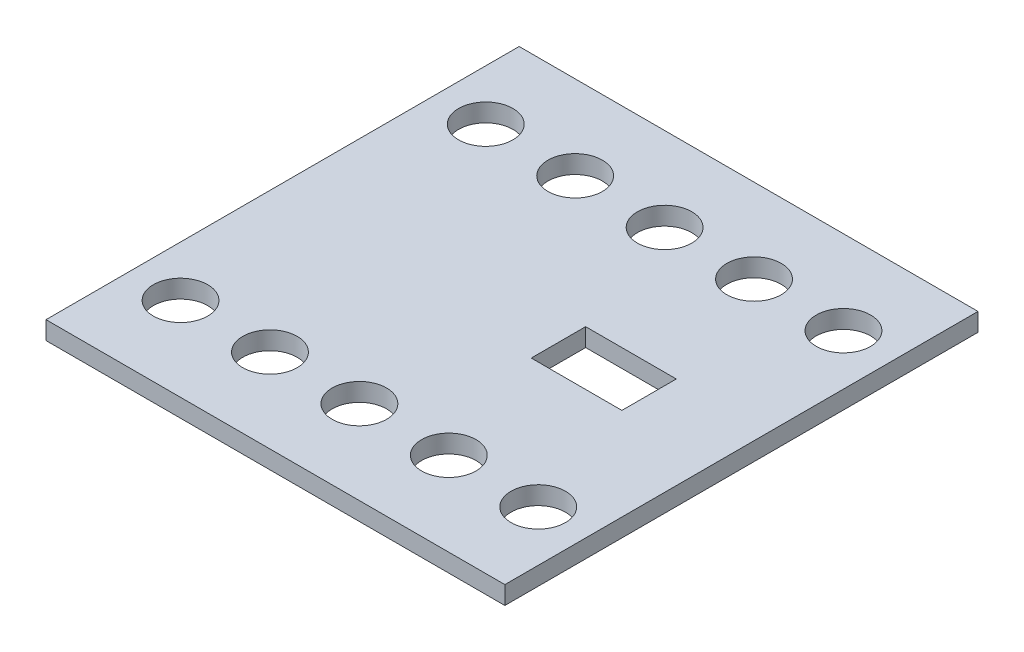
ISO-10303-21;
HEADER;
FILE_DESCRIPTION(('STEP AP214'),'2;1');
FILE_NAME('part.step','',(''),(''),'','','');
FILE_SCHEMA(('AUTOMOTIVE_DESIGN { 1 0 10303 214 1 1 1 1 }'));
ENDSEC;
DATA;
#1=APPLICATION_CONTEXT('core data for automotive mechanical design processes');
#2=APPLICATION_PROTOCOL_DEFINITION('international standard','automotive_design',2000,#1);
#3=PRODUCT_CONTEXT('',#1,'mechanical');
#4=PRODUCT('Part','Part','',(#3));
#5=PRODUCT_RELATED_PRODUCT_CATEGORY('part','',(#4));
#6=PRODUCT_DEFINITION_FORMATION('','',#4);
#7=PRODUCT_DEFINITION_CONTEXT('part definition',#1,'design');
#8=PRODUCT_DEFINITION('design','',#6,#7);
#9=PRODUCT_DEFINITION_SHAPE('','',#8);
#10=(LENGTH_UNIT() NAMED_UNIT(*) SI_UNIT(.MILLI.,.METRE.));
#11=(NAMED_UNIT(*) PLANE_ANGLE_UNIT() SI_UNIT($,.RADIAN.));
#12=(NAMED_UNIT(*) SI_UNIT($,.STERADIAN.) SOLID_ANGLE_UNIT());
#13=UNCERTAINTY_MEASURE_WITH_UNIT(LENGTH_MEASURE(1.E-05),#10,'distance_accuracy_value','');
#14=(GEOMETRIC_REPRESENTATION_CONTEXT(3) GLOBAL_UNCERTAINTY_ASSIGNED_CONTEXT((#13)) GLOBAL_UNIT_ASSIGNED_CONTEXT((#10,
#11,#12)) REPRESENTATION_CONTEXT('',''));
#15=CARTESIAN_POINT('',(0.,0.,0.));
#16=DIRECTION('',(0.,0.,1.));
#17=DIRECTION('',(1.,0.,0.));
#18=AXIS2_PLACEMENT_3D('',#15,#16,#17);
#19=CARTESIAN_POINT('',(-12.214606,-56.16702,0.));
#20=DIRECTION('',(0.,-1.,0.));
#21=DIRECTION('',(0.,0.,-1.));
#22=AXIS2_PLACEMENT_3D('',#19,#20,#21);
#23=PLANE('',#22);
#24=DIRECTION('',(0.,0.,-1.));
#25=VECTOR('',#24,1.);
#26=CARTESIAN_POINT('',(-20.250531,-56.16702,0.));
#27=LINE('',#26,#25);
#28=CARTESIAN_POINT('',(-20.250531,-56.16702,-3.61616625));
#29=VERTEX_POINT('',#28);
#30=CARTESIAN_POINT('',(-20.250531,-56.16702,3.61616625));
#31=VERTEX_POINT('',#30);
#32=EDGE_CURVE('E105',#29,#31,#27,.F.);
#33=ORIENTED_EDGE('',*,*,#32,.F.);
#34=DIRECTION('',(1.,0.,0.));
#35=VECTOR('',#34,1.);
#36=CARTESIAN_POINT('',(-12.214606,-56.16702,-3.61616625));
#37=LINE('',#36,#35);
#38=CARTESIAN_POINT('',(-4.178681,-56.16702,-3.61616625));
#39=VERTEX_POINT('',#38);
#40=EDGE_CURVE('E107',#39,#29,#37,.F.);
#41=ORIENTED_EDGE('',*,*,#40,.F.);
#42=DIRECTION('',(0.,0.,1.));
#43=VECTOR('',#42,1.);
#44=CARTESIAN_POINT('',(-4.178681,-56.16702,0.));
#45=LINE('',#44,#43);
#46=CARTESIAN_POINT('',(-4.178681,-56.16702,3.61616625));
#47=VERTEX_POINT('',#46);
#48=EDGE_CURVE('E208',#47,#39,#45,.F.);
#49=ORIENTED_EDGE('',*,*,#48,.F.);
#50=DIRECTION('',(1.,0.,0.));
#51=VECTOR('',#50,1.);
#52=CARTESIAN_POINT('',(-12.214606,-56.16702,3.61616625));
#53=LINE('',#52,#51);
#54=EDGE_CURVE('E103',#47,#31,#53,.F.);
#55=ORIENTED_EDGE('',*,*,#54,.T.);
#56=EDGE_LOOP('',(#33,#41,#49,#55));
#57=FACE_BOUND('',#56,.T.);
#58=ADVANCED_FACE('F17',(#57),#23,.T.);
#59=CARTESIAN_POINT('',(-12.214606,-56.43372,-3.61616625));
#60=DIRECTION('',(0.,0.,1.));
#61=DIRECTION('',(1.,0.,0.));
#62=AXIS2_PLACEMENT_3D('',#59,#60,#61);
#63=PLANE('',#62);
#64=DIRECTION('',(0.,1.,0.));
#65=VECTOR('',#64,1.);
#66=CARTESIAN_POINT('',(-20.250531,-56.43372,-3.61616625));
#67=LINE('',#66,#65);
#68=CARTESIAN_POINT('',(-20.250531,-56.70042,-3.61616625));
#69=VERTEX_POINT('',#68);
#70=EDGE_CURVE('E112',#69,#29,#67,.T.);
#71=ORIENTED_EDGE('',*,*,#70,.F.);
#72=DIRECTION('',(1.,0.,0.));
#73=VECTOR('',#72,1.);
#74=CARTESIAN_POINT('',(22.50059,-56.70042,-3.61616625));
#75=LINE('',#74,#73);
#76=CARTESIAN_POINT('',(-4.178681,-56.70042,-3.61616625));
#77=VERTEX_POINT('',#76);
#78=EDGE_CURVE('E205',#77,#69,#75,.F.);
#79=ORIENTED_EDGE('',*,*,#78,.F.);
#80=DIRECTION('',(0.,1.,0.));
#81=VECTOR('',#80,1.);
#82=CARTESIAN_POINT('',(-4.178681,-56.43372,-3.61616625));
#83=LINE('',#82,#81);
#84=EDGE_CURVE('E118',#39,#77,#83,.F.);
#85=ORIENTED_EDGE('',*,*,#84,.F.);
#86=ORIENTED_EDGE('',*,*,#40,.T.);
#87=EDGE_LOOP('',(#71,#79,#85,#86));
#88=FACE_BOUND('',#87,.T.);
#89=ADVANCED_FACE('F115',(#88),#63,.T.);
#90=CARTESIAN_POINT('',(-20.250531,-56.43372,0.));
#91=DIRECTION('',(1.,0.,0.));
#92=DIRECTION('',(0.,0.,-1.));
#93=AXIS2_PLACEMENT_3D('',#90,#91,#92);
#94=PLANE('',#93);
#95=DIRECTION('',(0.,0.,-1.));
#96=VECTOR('',#95,1.);
#97=CARTESIAN_POINT('',(-20.250531,-56.70042,-23.20036));
#98=LINE('',#97,#96);
#99=CARTESIAN_POINT('',(-20.250531,-56.70042,3.61616625));
#100=VERTEX_POINT('',#99);
#101=EDGE_CURVE('E123',#69,#100,#98,.F.);
#102=ORIENTED_EDGE('',*,*,#101,.F.);
#103=ORIENTED_EDGE('',*,*,#70,.T.);
#104=ORIENTED_EDGE('',*,*,#32,.T.);
#105=DIRECTION('',(0.,1.,0.));
#106=VECTOR('',#105,1.);
#107=CARTESIAN_POINT('',(-20.250531,-56.43372,3.61616625));
#108=LINE('',#107,#106);
#109=EDGE_CURVE('E126',#31,#100,#108,.F.);
#110=ORIENTED_EDGE('',*,*,#109,.T.);
#111=EDGE_LOOP('',(#102,#103,#104,#110));
#112=FACE_BOUND('',#111,.T.);
#113=ADVANCED_FACE('F121',(#112),#94,.T.);
#114=CARTESIAN_POINT('',(-12.214606,-56.43372,3.61616625));
#115=DIRECTION('',(0.,0.,1.));
#116=DIRECTION('',(1.,0.,0.));
#117=AXIS2_PLACEMENT_3D('',#114,#115,#116);
#118=PLANE('',#117);
#119=DIRECTION('',(1.,0.,0.));
#120=VECTOR('',#119,1.);
#121=CARTESIAN_POINT('',(22.50059,-56.70042,3.61616625));
#122=LINE('',#121,#120);
#123=CARTESIAN_POINT('',(-4.178681,-56.70042,3.61616625));
#124=VERTEX_POINT('',#123);
#125=EDGE_CURVE('E195',#100,#124,#122,.T.);
#126=ORIENTED_EDGE('',*,*,#125,.F.);
#127=ORIENTED_EDGE('',*,*,#109,.F.);
#128=ORIENTED_EDGE('',*,*,#54,.F.);
#129=DIRECTION('',(0.,1.,0.));
#130=VECTOR('',#129,1.);
#131=CARTESIAN_POINT('',(-4.178681,-56.43372,3.61616625));
#132=LINE('',#131,#130);
#133=EDGE_CURVE('E210',#124,#47,#132,.T.);
#134=ORIENTED_EDGE('',*,*,#133,.F.);
#135=EDGE_LOOP('',(#126,#127,#128,#134));
#136=FACE_BOUND('',#135,.T.);
#137=ADVANCED_FACE('F214',(#136),#118,.F.);
#138=CARTESIAN_POINT('',(-4.178681,-56.43372,0.));
#139=DIRECTION('',(-1.,0.,0.));
#140=DIRECTION('',(0.,0.,1.));
#141=AXIS2_PLACEMENT_3D('',#138,#139,#140);
#142=PLANE('',#141);
#143=ORIENTED_EDGE('',*,*,#48,.T.);
#144=ORIENTED_EDGE('',*,*,#84,.T.);
#145=DIRECTION('',(0.,0.,-1.));
#146=VECTOR('',#145,1.);
#147=CARTESIAN_POINT('',(-4.178681,-56.70042,-23.20036));
#148=LINE('',#147,#146);
#149=EDGE_CURVE('E191',#124,#77,#148,.T.);
#150=ORIENTED_EDGE('',*,*,#149,.F.);
#151=ORIENTED_EDGE('',*,*,#133,.T.);
#152=EDGE_LOOP('',(#143,#144,#150,#151));
#153=FACE_BOUND('',#152,.T.);
#154=ADVANCED_FACE('F218',(#153),#142,.T.);
#155=CARTESIAN_POINT('',(22.50059,-56.70042,-23.20036));
#156=DIRECTION('',(0.,-1.,0.));
#157=DIRECTION('',(0.,0.,-1.));
#158=AXIS2_PLACEMENT_3D('',#155,#156,#157);
#159=PLANE('',#158);
#160=DIRECTION('',(1.,0.,0.));
#161=VECTOR('',#160,1.);
#162=CARTESIAN_POINT('',(0.,-56.70042,-23.20036));
#163=LINE('',#162,#161);
#164=CARTESIAN_POINT('',(-22.50059,-56.70042,-23.20036));
#165=VERTEX_POINT('',#164);
#166=CARTESIAN_POINT('',(22.50059,-56.70042,-23.20036));
#167=VERTEX_POINT('',#166);
#168=EDGE_CURVE('E558',#165,#167,#163,.T.);
#169=ORIENTED_EDGE('',*,*,#168,.T.);
#170=DIRECTION('',(0.,0.,-1.));
#171=VECTOR('',#170,1.);
#172=CARTESIAN_POINT('',(22.50059,-56.70042,-23.20036));
#173=LINE('',#172,#171);
#174=CARTESIAN_POINT('',(22.50059,-56.70042,23.20036));
#175=VERTEX_POINT('',#174);
#176=EDGE_CURVE('E560',#175,#167,#173,.T.);
#177=ORIENTED_EDGE('',*,*,#176,.F.);
#178=DIRECTION('',(1.,0.,0.));
#179=VECTOR('',#178,1.);
#180=CARTESIAN_POINT('',(0.,-56.70042,23.20036));
#181=LINE('',#180,#179);
#182=CARTESIAN_POINT('',(-22.50059,-56.70042,23.20036));
#183=VERTEX_POINT('',#182);
#184=EDGE_CURVE('E519',#183,#175,#181,.T.);
#185=ORIENTED_EDGE('',*,*,#184,.F.);
#186=DIRECTION('',(0.,0.,1.));
#187=VECTOR('',#186,1.);
#188=CARTESIAN_POINT('',(-22.50059,-56.70042,-23.20036));
#189=LINE('',#188,#187);
#190=EDGE_CURVE('E161',#165,#183,#189,.T.);
#191=ORIENTED_EDGE('',*,*,#190,.F.);
#192=EDGE_LOOP('',(#169,#177,#185,#191));
#193=FACE_BOUND('',#192,.T.);
#194=DIRECTION('',(1.,0.,0.));
#195=VECTOR('',#194,1.);
#196=CARTESIAN_POINT('',(9.000236,-56.70042,2.667));
#197=LINE('',#196,#195);
#198=CARTESIAN_POINT('',(4.555236,-56.70042,2.667));
#199=VERTEX_POINT('',#198);
#200=CARTESIAN_POINT('',(13.445236,-56.70042,2.667));
#201=VERTEX_POINT('',#200);
#202=EDGE_CURVE('E532',#199,#201,#197,.T.);
#203=ORIENTED_EDGE('',*,*,#202,.T.);
#204=DIRECTION('',(0.,0.,1.));
#205=VECTOR('',#204,1.);
#206=CARTESIAN_POINT('',(13.445236,-56.70042,0.));
#207=LINE('',#206,#205);
#208=CARTESIAN_POINT('',(13.445236,-56.70042,-2.667));
#209=VERTEX_POINT('',#208);
#210=EDGE_CURVE('E535',#209,#201,#207,.T.);
#211=ORIENTED_EDGE('',*,*,#210,.F.);
#212=DIRECTION('',(1.,0.,0.));
#213=VECTOR('',#212,1.);
#214=CARTESIAN_POINT('',(9.000236,-56.70042,-2.667));
#215=LINE('',#214,#213);
#216=CARTESIAN_POINT('',(4.555236,-56.70042,-2.667));
#217=VERTEX_POINT('',#216);
#218=EDGE_CURVE('E165',#217,#209,#215,.T.);
#219=ORIENTED_EDGE('',*,*,#218,.F.);
#220=DIRECTION('',(0.,0.,-1.));
#221=VECTOR('',#220,1.);
#222=CARTESIAN_POINT('',(4.555236,-56.70042,0.));
#223=LINE('',#222,#221);
#224=EDGE_CURVE('E520',#199,#217,#223,.T.);
#225=ORIENTED_EDGE('',*,*,#224,.F.);
#226=EDGE_LOOP('',(#203,#211,#219,#225));
#227=FACE_BOUND('',#226,.T.);
#228=ORIENTED_EDGE('',*,*,#125,.T.);
#229=ORIENTED_EDGE('',*,*,#149,.T.);
#230=ORIENTED_EDGE('',*,*,#78,.T.);
#231=ORIENTED_EDGE('',*,*,#101,.T.);
#232=EDGE_LOOP('',(#228,#229,#230,#231));
#233=FACE_BOUND('',#232,.T.);
#234=CARTESIAN_POINT('',(-17.5403933333333,-56.70042,-14.966315));
#235=DIRECTION('',(0.,-1.,0.));
#236=DIRECTION('',(0.,0.,-1.));
#237=AXIS2_PLACEMENT_3D('',#234,#235,#236);
#238=CIRCLE('',#237,2.667);
#239=CARTESIAN_POINT('',(-17.5403933333333,-56.70042,-17.633315));
#240=VERTEX_POINT('',#239);
#241=EDGE_CURVE('E162',#240,#240,#238,.F.);
#242=ORIENTED_EDGE('',*,*,#241,.T.);
#243=EDGE_LOOP('',(#242));
#244=FACE_BOUND('',#243,.T.);
#245=CARTESIAN_POINT('',(-8.77019666666667,-56.70042,-14.966315));
#246=DIRECTION('',(0.,-1.,0.));
#247=DIRECTION('',(0.,0.,-1.));
#248=AXIS2_PLACEMENT_3D('',#245,#246,#247);
#249=CIRCLE('',#248,2.667);
#250=CARTESIAN_POINT('',(-8.77019666666667,-56.70042,-17.633315));
#251=VERTEX_POINT('',#250);
#252=EDGE_CURVE('E166',#251,#251,#249,.F.);
#253=ORIENTED_EDGE('',*,*,#252,.T.);
#254=EDGE_LOOP('',(#253));
#255=FACE_BOUND('',#254,.T.);
#256=CARTESIAN_POINT('',(0.,-56.70042,-14.966315));
#257=DIRECTION('',(0.,-1.,0.));
#258=DIRECTION('',(0.,0.,-1.));
#259=AXIS2_PLACEMENT_3D('',#256,#257,#258);
#260=CIRCLE('',#259,2.667);
#261=CARTESIAN_POINT('',(0.,-56.70042,-17.633315));
#262=VERTEX_POINT('',#261);
#263=EDGE_CURVE('E169',#262,#262,#260,.F.);
#264=ORIENTED_EDGE('',*,*,#263,.T.);
#265=EDGE_LOOP('',(#264));
#266=FACE_BOUND('',#265,.T.);
#267=CARTESIAN_POINT('',(8.77019666666667,-56.70042,-14.966315));
#268=DIRECTION('',(0.,-1.,0.));
#269=DIRECTION('',(0.,0.,-1.));
#270=AXIS2_PLACEMENT_3D('',#267,#268,#269);
#271=CIRCLE('',#270,2.667);
#272=CARTESIAN_POINT('',(8.77019666666667,-56.70042,-17.633315));
#273=VERTEX_POINT('',#272);
#274=EDGE_CURVE('E172',#273,#273,#271,.F.);
#275=ORIENTED_EDGE('',*,*,#274,.T.);
#276=EDGE_LOOP('',(#275));
#277=FACE_BOUND('',#276,.T.);
#278=CARTESIAN_POINT('',(17.5403933333333,-56.70042,-14.966315));
#279=DIRECTION('',(0.,-1.,0.));
#280=DIRECTION('',(0.,0.,-1.));
#281=AXIS2_PLACEMENT_3D('',#278,#279,#280);
#282=CIRCLE('',#281,2.667);
#283=CARTESIAN_POINT('',(17.5403933333333,-56.70042,-17.633315));
#284=VERTEX_POINT('',#283);
#285=EDGE_CURVE('E175',#284,#284,#282,.F.);
#286=ORIENTED_EDGE('',*,*,#285,.T.);
#287=EDGE_LOOP('',(#286));
#288=FACE_BOUND('',#287,.T.);
#289=CARTESIAN_POINT('',(-17.5403933333333,-56.70042,14.966315));
#290=DIRECTION('',(0.,-1.,0.));
#291=DIRECTION('',(0.,0.,-1.));
#292=AXIS2_PLACEMENT_3D('',#289,#290,#291);
#293=CIRCLE('',#292,2.667);
#294=CARTESIAN_POINT('',(-17.5403933333333,-56.70042,12.299315));
#295=VERTEX_POINT('',#294);
#296=EDGE_CURVE('E178',#295,#295,#293,.F.);
#297=ORIENTED_EDGE('',*,*,#296,.T.);
#298=EDGE_LOOP('',(#297));
#299=FACE_BOUND('',#298,.T.);
#300=CARTESIAN_POINT('',(-8.77019666666667,-56.70042,14.966315));
#301=DIRECTION('',(0.,-1.,0.));
#302=DIRECTION('',(0.,0.,-1.));
#303=AXIS2_PLACEMENT_3D('',#300,#301,#302);
#304=CIRCLE('',#303,2.667);
#305=CARTESIAN_POINT('',(-8.77019666666667,-56.70042,12.299315));
#306=VERTEX_POINT('',#305);
#307=EDGE_CURVE('E181',#306,#306,#304,.F.);
#308=ORIENTED_EDGE('',*,*,#307,.T.);
#309=EDGE_LOOP('',(#308));
#310=FACE_BOUND('',#309,.T.);
#311=CARTESIAN_POINT('',(0.,-56.70042,14.966315));
#312=DIRECTION('',(0.,-1.,0.));
#313=DIRECTION('',(0.,0.,-1.));
#314=AXIS2_PLACEMENT_3D('',#311,#312,#313);
#315=CIRCLE('',#314,2.667);
#316=CARTESIAN_POINT('',(0.,-56.70042,12.299315));
#317=VERTEX_POINT('',#316);
#318=EDGE_CURVE('E184',#317,#317,#315,.F.);
#319=ORIENTED_EDGE('',*,*,#318,.T.);
#320=EDGE_LOOP('',(#319));
#321=FACE_BOUND('',#320,.T.);
#322=CARTESIAN_POINT('',(8.77019666666667,-56.70042,14.966315));
#323=DIRECTION('',(0.,-1.,0.));
#324=DIRECTION('',(0.,0.,-1.));
#325=AXIS2_PLACEMENT_3D('',#322,#323,#324);
#326=CIRCLE('',#325,2.667);
#327=CARTESIAN_POINT('',(8.77019666666667,-56.70042,12.299315));
#328=VERTEX_POINT('',#327);
#329=EDGE_CURVE('E186',#328,#328,#326,.F.);
#330=ORIENTED_EDGE('',*,*,#329,.T.);
#331=EDGE_LOOP('',(#330));
#332=FACE_BOUND('',#331,.T.);
#333=CARTESIAN_POINT('',(17.5403933333333,-56.70042,14.966315));
#334=DIRECTION('',(0.,-1.,0.));
#335=DIRECTION('',(0.,0.,-1.));
#336=AXIS2_PLACEMENT_3D('',#333,#334,#335);
#337=CIRCLE('',#336,2.667);
#338=CARTESIAN_POINT('',(17.5403933333333,-56.70042,12.299315));
#339=VERTEX_POINT('',#338);
#340=EDGE_CURVE('E20',#339,#339,#337,.F.);
#341=ORIENTED_EDGE('',*,*,#340,.T.);
#342=EDGE_LOOP('',(#341));
#343=FACE_BOUND('',#342,.T.);
#344=ADVANCED_FACE('F215',(#193,#227,#233,#244,#255,#266,#277,#288,#299,#310,#321,#332,#343),
#159,.T.);
#345=CARTESIAN_POINT('',(17.5403933333333,-55.81142,14.966315));
#346=DIRECTION('',(0.,-1.,0.));
#347=DIRECTION('',(0.,0.,-1.));
#348=AXIS2_PLACEMENT_3D('',#345,#346,#347);
#349=CYLINDRICAL_SURFACE('',#348,2.667);
#350=CARTESIAN_POINT('',(17.5403933333333,-54.92242,14.966315));
#351=DIRECTION('',(0.,-1.,0.));
#352=DIRECTION('',(0.,0.,-1.));
#353=AXIS2_PLACEMENT_3D('',#350,#351,#352);
#354=CIRCLE('',#353,2.667);
#355=CARTESIAN_POINT('',(17.5403933333333,-54.92242,12.299315));
#356=VERTEX_POINT('',#355);
#357=EDGE_CURVE('E158',#356,#356,#354,.T.);
#358=ORIENTED_EDGE('',*,*,#357,.F.);
#359=EDGE_LOOP('',(#358));
#360=FACE_BOUND('',#359,.T.);
#361=ORIENTED_EDGE('',*,*,#340,.F.);
#362=EDGE_LOOP('',(#361));
#363=FACE_BOUND('',#362,.T.);
#364=ADVANCED_FACE('F226',(#360,#363),#349,.F.);
#365=CARTESIAN_POINT('',(8.77019666666667,-55.81142,14.966315));
#366=DIRECTION('',(0.,-1.,0.));
#367=DIRECTION('',(0.,0.,-1.));
#368=AXIS2_PLACEMENT_3D('',#365,#366,#367);
#369=CYLINDRICAL_SURFACE('',#368,2.667);
#370=CARTESIAN_POINT('',(8.77019666666667,-54.92242,14.966315));
#371=DIRECTION('',(0.,-1.,0.));
#372=DIRECTION('',(0.,0.,-1.));
#373=AXIS2_PLACEMENT_3D('',#370,#371,#372);
#374=CIRCLE('',#373,2.667);
#375=CARTESIAN_POINT('',(8.77019666666667,-54.92242,12.299315));
#376=VERTEX_POINT('',#375);
#377=EDGE_CURVE('E155',#376,#376,#374,.T.);
#378=ORIENTED_EDGE('',*,*,#377,.F.);
#379=EDGE_LOOP('',(#378));
#380=FACE_BOUND('',#379,.T.);
#381=ORIENTED_EDGE('',*,*,#329,.F.);
#382=EDGE_LOOP('',(#381));
#383=FACE_BOUND('',#382,.T.);
#384=ADVANCED_FACE('F301',(#380,#383),#369,.F.);
#385=CARTESIAN_POINT('',(0.,-55.81142,14.966315));
#386=DIRECTION('',(0.,-1.,0.));
#387=DIRECTION('',(0.,0.,-1.));
#388=AXIS2_PLACEMENT_3D('',#385,#386,#387);
#389=CYLINDRICAL_SURFACE('',#388,2.667);
#390=CARTESIAN_POINT('',(0.,-54.92242,14.966315));
#391=DIRECTION('',(0.,-1.,0.));
#392=DIRECTION('',(0.,0.,-1.));
#393=AXIS2_PLACEMENT_3D('',#390,#391,#392);
#394=CIRCLE('',#393,2.667);
#395=CARTESIAN_POINT('',(0.,-54.92242,12.299315));
#396=VERTEX_POINT('',#395);
#397=EDGE_CURVE('E152',#396,#396,#394,.T.);
#398=ORIENTED_EDGE('',*,*,#397,.F.);
#399=EDGE_LOOP('',(#398));
#400=FACE_BOUND('',#399,.T.);
#401=ORIENTED_EDGE('',*,*,#318,.F.);
#402=EDGE_LOOP('',(#401));
#403=FACE_BOUND('',#402,.T.);
#404=ADVANCED_FACE('F297',(#400,#403),#389,.F.);
#405=CARTESIAN_POINT('',(-8.77019666666667,-55.81142,14.966315));
#406=DIRECTION('',(0.,-1.,0.));
#407=DIRECTION('',(0.,0.,-1.));
#408=AXIS2_PLACEMENT_3D('',#405,#406,#407);
#409=CYLINDRICAL_SURFACE('',#408,2.667);
#410=CARTESIAN_POINT('',(-8.77019666666667,-54.92242,14.966315));
#411=DIRECTION('',(0.,-1.,0.));
#412=DIRECTION('',(0.,0.,-1.));
#413=AXIS2_PLACEMENT_3D('',#410,#411,#412);
#414=CIRCLE('',#413,2.667);
#415=CARTESIAN_POINT('',(-8.77019666666667,-54.92242,12.299315));
#416=VERTEX_POINT('',#415);
#417=EDGE_CURVE('E149',#416,#416,#414,.T.);
#418=ORIENTED_EDGE('',*,*,#417,.F.);
#419=EDGE_LOOP('',(#418));
#420=FACE_BOUND('',#419,.T.);
#421=ORIENTED_EDGE('',*,*,#307,.F.);
#422=EDGE_LOOP('',(#421));
#423=FACE_BOUND('',#422,.T.);
#424=ADVANCED_FACE('F293',(#420,#423),#409,.F.);
#425=CARTESIAN_POINT('',(-17.5403933333333,-55.81142,14.966315));
#426=DIRECTION('',(0.,-1.,0.));
#427=DIRECTION('',(0.,0.,-1.));
#428=AXIS2_PLACEMENT_3D('',#425,#426,#427);
#429=CYLINDRICAL_SURFACE('',#428,2.667);
#430=CARTESIAN_POINT('',(-17.5403933333333,-54.92242,14.966315));
#431=DIRECTION('',(0.,-1.,0.));
#432=DIRECTION('',(0.,0.,-1.));
#433=AXIS2_PLACEMENT_3D('',#430,#431,#432);
#434=CIRCLE('',#433,2.667);
#435=CARTESIAN_POINT('',(-17.5403933333333,-54.92242,12.299315));
#436=VERTEX_POINT('',#435);
#437=EDGE_CURVE('E146',#436,#436,#434,.T.);
#438=ORIENTED_EDGE('',*,*,#437,.F.);
#439=EDGE_LOOP('',(#438));
#440=FACE_BOUND('',#439,.T.);
#441=ORIENTED_EDGE('',*,*,#296,.F.);
#442=EDGE_LOOP('',(#441));
#443=FACE_BOUND('',#442,.T.);
#444=ADVANCED_FACE('F289',(#440,#443),#429,.F.);
#445=CARTESIAN_POINT('',(17.5403933333333,-55.81142,-14.966315));
#446=DIRECTION('',(0.,-1.,0.));
#447=DIRECTION('',(0.,0.,-1.));
#448=AXIS2_PLACEMENT_3D('',#445,#446,#447);
#449=CYLINDRICAL_SURFACE('',#448,2.667);
#450=CARTESIAN_POINT('',(17.5403933333333,-54.92242,-14.966315));
#451=DIRECTION('',(0.,-1.,0.));
#452=DIRECTION('',(0.,0.,-1.));
#453=AXIS2_PLACEMENT_3D('',#450,#451,#452);
#454=CIRCLE('',#453,2.667);
#455=CARTESIAN_POINT('',(17.5403933333333,-54.92242,-17.633315));
#456=VERTEX_POINT('',#455);
#457=EDGE_CURVE('E143',#456,#456,#454,.T.);
#458=ORIENTED_EDGE('',*,*,#457,.F.);
#459=EDGE_LOOP('',(#458));
#460=FACE_BOUND('',#459,.T.);
#461=ORIENTED_EDGE('',*,*,#285,.F.);
#462=EDGE_LOOP('',(#461));
#463=FACE_BOUND('',#462,.T.);
#464=ADVANCED_FACE('F285',(#460,#463),#449,.F.);
#465=CARTESIAN_POINT('',(8.77019666666667,-55.81142,-14.966315));
#466=DIRECTION('',(0.,-1.,0.));
#467=DIRECTION('',(0.,0.,-1.));
#468=AXIS2_PLACEMENT_3D('',#465,#466,#467);
#469=CYLINDRICAL_SURFACE('',#468,2.667);
#470=CARTESIAN_POINT('',(8.77019666666667,-54.92242,-14.966315));
#471=DIRECTION('',(0.,-1.,0.));
#472=DIRECTION('',(0.,0.,-1.));
#473=AXIS2_PLACEMENT_3D('',#470,#471,#472);
#474=CIRCLE('',#473,2.667);
#475=CARTESIAN_POINT('',(8.77019666666667,-54.92242,-17.633315));
#476=VERTEX_POINT('',#475);
#477=EDGE_CURVE('E140',#476,#476,#474,.T.);
#478=ORIENTED_EDGE('',*,*,#477,.F.);
#479=EDGE_LOOP('',(#478));
#480=FACE_BOUND('',#479,.T.);
#481=ORIENTED_EDGE('',*,*,#274,.F.);
#482=EDGE_LOOP('',(#481));
#483=FACE_BOUND('',#482,.T.);
#484=ADVANCED_FACE('F281',(#480,#483),#469,.F.);
#485=CARTESIAN_POINT('',(0.,-55.81142,-14.966315));
#486=DIRECTION('',(0.,-1.,0.));
#487=DIRECTION('',(0.,0.,-1.));
#488=AXIS2_PLACEMENT_3D('',#485,#486,#487);
#489=CYLINDRICAL_SURFACE('',#488,2.667);
#490=CARTESIAN_POINT('',(0.,-54.92242,-14.966315));
#491=DIRECTION('',(0.,-1.,0.));
#492=DIRECTION('',(0.,0.,-1.));
#493=AXIS2_PLACEMENT_3D('',#490,#491,#492);
#494=CIRCLE('',#493,2.667);
#495=CARTESIAN_POINT('',(0.,-54.92242,-17.633315));
#496=VERTEX_POINT('',#495);
#497=EDGE_CURVE('E137',#496,#496,#494,.T.);
#498=ORIENTED_EDGE('',*,*,#497,.F.);
#499=EDGE_LOOP('',(#498));
#500=FACE_BOUND('',#499,.T.);
#501=ORIENTED_EDGE('',*,*,#263,.F.);
#502=EDGE_LOOP('',(#501));
#503=FACE_BOUND('',#502,.T.);
#504=ADVANCED_FACE('F277',(#500,#503),#489,.F.);
#505=CARTESIAN_POINT('',(-8.77019666666667,-55.81142,-14.966315));
#506=DIRECTION('',(0.,-1.,0.));
#507=DIRECTION('',(0.,0.,-1.));
#508=AXIS2_PLACEMENT_3D('',#505,#506,#507);
#509=CYLINDRICAL_SURFACE('',#508,2.667);
#510=CARTESIAN_POINT('',(-8.77019666666667,-54.92242,-14.966315));
#511=DIRECTION('',(0.,-1.,0.));
#512=DIRECTION('',(0.,0.,-1.));
#513=AXIS2_PLACEMENT_3D('',#510,#511,#512);
#514=CIRCLE('',#513,2.667);
#515=CARTESIAN_POINT('',(-8.77019666666667,-54.92242,-17.633315));
#516=VERTEX_POINT('',#515);
#517=EDGE_CURVE('E134',#516,#516,#514,.T.);
#518=ORIENTED_EDGE('',*,*,#517,.F.);
#519=EDGE_LOOP('',(#518));
#520=FACE_BOUND('',#519,.T.);
#521=ORIENTED_EDGE('',*,*,#252,.F.);
#522=EDGE_LOOP('',(#521));
#523=FACE_BOUND('',#522,.T.);
#524=ADVANCED_FACE('F273',(#520,#523),#509,.F.);
#525=CARTESIAN_POINT('',(-17.5403933333333,-55.81142,-14.966315));
#526=DIRECTION('',(0.,-1.,0.));
#527=DIRECTION('',(0.,0.,-1.));
#528=AXIS2_PLACEMENT_3D('',#525,#526,#527);
#529=CYLINDRICAL_SURFACE('',#528,2.667);
#530=CARTESIAN_POINT('',(-17.5403933333333,-54.92242,-14.966315));
#531=DIRECTION('',(0.,-1.,0.));
#532=DIRECTION('',(0.,0.,-1.));
#533=AXIS2_PLACEMENT_3D('',#530,#531,#532);
#534=CIRCLE('',#533,2.667);
#535=CARTESIAN_POINT('',(-17.5403933333333,-54.92242,-17.633315));
#536=VERTEX_POINT('',#535);
#537=EDGE_CURVE('E130',#536,#536,#534,.T.);
#538=ORIENTED_EDGE('',*,*,#537,.F.);
#539=EDGE_LOOP('',(#538));
#540=FACE_BOUND('',#539,.T.);
#541=ORIENTED_EDGE('',*,*,#241,.F.);
#542=EDGE_LOOP('',(#541));
#543=FACE_BOUND('',#542,.T.);
#544=ADVANCED_FACE('F269',(#540,#543),#529,.F.);
#545=CARTESIAN_POINT('',(9.000236,-55.81142,-2.667));
#546=DIRECTION('',(0.,0.,1.));
#547=DIRECTION('',(1.,0.,0.));
#548=AXIS2_PLACEMENT_3D('',#545,#546,#547);
#549=PLANE('',#548);
#550=DIRECTION('',(0.,1.,0.));
#551=VECTOR('',#550,1.);
#552=CARTESIAN_POINT('',(4.555236,-55.81142,-2.667));
#553=LINE('',#552,#551);
#554=CARTESIAN_POINT('',(4.555236,-54.92242,-2.667));
#555=VERTEX_POINT('',#554);
#556=EDGE_CURVE('E513',#217,#555,#553,.T.);
#557=ORIENTED_EDGE('',*,*,#556,.F.);
#558=ORIENTED_EDGE('',*,*,#218,.T.);
#559=DIRECTION('',(0.,1.,0.));
#560=VECTOR('',#559,1.);
#561=CARTESIAN_POINT('',(13.445236,-55.81142,-2.667));
#562=LINE('',#561,#560);
#563=CARTESIAN_POINT('',(13.445236,-54.92242,-2.667));
#564=VERTEX_POINT('',#563);
#565=EDGE_CURVE('E534',#564,#209,#562,.F.);
#566=ORIENTED_EDGE('',*,*,#565,.F.);
#567=DIRECTION('',(-1.,0.,0.));
#568=VECTOR('',#567,1.);
#569=CARTESIAN_POINT('',(-22.50059,-54.92242,-2.667));
#570=LINE('',#569,#568);
#571=EDGE_CURVE('E133',#555,#564,#570,.F.);
#572=ORIENTED_EDGE('',*,*,#571,.F.);
#573=EDGE_LOOP('',(#557,#558,#566,#572));
#574=FACE_BOUND('',#573,.T.);
#575=ADVANCED_FACE('F265',(#574),#549,.T.);
#576=CARTESIAN_POINT('',(13.445236,-55.81142,0.));
#577=DIRECTION('',(-1.,0.,0.));
#578=DIRECTION('',(0.,0.,1.));
#579=AXIS2_PLACEMENT_3D('',#576,#577,#578);
#580=PLANE('',#579);
#581=DIRECTION('',(0.,0.,1.));
#582=VECTOR('',#581,1.);
#583=CARTESIAN_POINT('',(13.445236,-54.92242,-23.20036));
#584=LINE('',#583,#582);
#585=CARTESIAN_POINT('',(13.445236,-54.92242,2.667));
#586=VERTEX_POINT('',#585);
#587=EDGE_CURVE('E544',#564,#586,#584,.T.);
#588=ORIENTED_EDGE('',*,*,#587,.F.);
#589=ORIENTED_EDGE('',*,*,#565,.T.);
#590=ORIENTED_EDGE('',*,*,#210,.T.);
#591=DIRECTION('',(0.,1.,0.));
#592=VECTOR('',#591,1.);
#593=CARTESIAN_POINT('',(13.445236,-55.81142,2.667));
#594=LINE('',#593,#592);
#595=EDGE_CURVE('E527',#201,#586,#594,.T.);
#596=ORIENTED_EDGE('',*,*,#595,.T.);
#597=EDGE_LOOP('',(#588,#589,#590,#596));
#598=FACE_BOUND('',#597,.T.);
#599=ADVANCED_FACE('F261',(#598),#580,.T.);
#600=CARTESIAN_POINT('',(9.000236,-55.81142,2.667));
#601=DIRECTION('',(0.,0.,1.));
#602=DIRECTION('',(1.,0.,0.));
#603=AXIS2_PLACEMENT_3D('',#600,#601,#602);
#604=PLANE('',#603);
#605=ORIENTED_EDGE('',*,*,#202,.F.);
#606=DIRECTION('',(0.,1.,0.));
#607=VECTOR('',#606,1.);
#608=CARTESIAN_POINT('',(4.555236,-55.81142,2.667));
#609=LINE('',#608,#607);
#610=CARTESIAN_POINT('',(4.555236,-54.92242,2.667));
#611=VERTEX_POINT('',#610);
#612=EDGE_CURVE('E524',#611,#199,#609,.F.);
#613=ORIENTED_EDGE('',*,*,#612,.F.);
#614=DIRECTION('',(-1.,0.,0.));
#615=VECTOR('',#614,1.);
#616=CARTESIAN_POINT('',(-22.50059,-54.92242,2.667));
#617=LINE('',#616,#615);
#618=EDGE_CURVE('E541',#586,#611,#617,.T.);
#619=ORIENTED_EDGE('',*,*,#618,.F.);
#620=ORIENTED_EDGE('',*,*,#595,.F.);
#621=EDGE_LOOP('',(#605,#613,#619,#620));
#622=FACE_BOUND('',#621,.T.);
#623=ADVANCED_FACE('F257',(#622),#604,.F.);
#624=CARTESIAN_POINT('',(4.555236,-55.81142,0.));
#625=DIRECTION('',(1.,0.,0.));
#626=DIRECTION('',(0.,0.,-1.));
#627=AXIS2_PLACEMENT_3D('',#624,#625,#626);
#628=PLANE('',#627);
#629=ORIENTED_EDGE('',*,*,#224,.T.);
#630=ORIENTED_EDGE('',*,*,#556,.T.);
#631=DIRECTION('',(0.,0.,1.));
#632=VECTOR('',#631,1.);
#633=CARTESIAN_POINT('',(4.555236,-54.92242,-23.20036));
#634=LINE('',#633,#632);
#635=EDGE_CURVE('E543',#611,#555,#634,.F.);
#636=ORIENTED_EDGE('',*,*,#635,.F.);
#637=ORIENTED_EDGE('',*,*,#612,.T.);
#638=EDGE_LOOP('',(#629,#630,#636,#637));
#639=FACE_BOUND('',#638,.T.);
#640=ADVANCED_FACE('F253',(#639),#628,.T.);
#641=CARTESIAN_POINT('',(0.,-55.81142,23.20036));
#642=DIRECTION('',(0.,0.,1.));
#643=DIRECTION('',(1.,0.,0.));
#644=AXIS2_PLACEMENT_3D('',#641,#642,#643);
#645=PLANE('',#644);
#646=DIRECTION('',(0.,1.,0.));
#647=VECTOR('',#646,1.);
#648=CARTESIAN_POINT('',(-22.50059,-56.70042,23.20036));
#649=LINE('',#648,#647);
#650=CARTESIAN_POINT('',(-22.50059,-54.92242,23.20036));
#651=VERTEX_POINT('',#650);
#652=EDGE_CURVE('E553',#183,#651,#649,.T.);
#653=ORIENTED_EDGE('',*,*,#652,.F.);
#654=ORIENTED_EDGE('',*,*,#184,.T.);
#655=DIRECTION('',(0.,1.,0.));
#656=VECTOR('',#655,1.);
#657=CARTESIAN_POINT('',(22.50059,-55.81142,23.20036));
#658=LINE('',#657,#656);
#659=CARTESIAN_POINT('',(22.50059,-54.92242,23.20036));
#660=VERTEX_POINT('',#659);
#661=EDGE_CURVE('E563',#660,#175,#658,.F.);
#662=ORIENTED_EDGE('',*,*,#661,.F.);
#663=DIRECTION('',(-1.,0.,0.));
#664=VECTOR('',#663,1.);
#665=CARTESIAN_POINT('',(-22.50059,-54.92242,23.20036));
#666=LINE('',#665,#664);
#667=EDGE_CURVE('E573',#651,#660,#666,.F.);
#668=ORIENTED_EDGE('',*,*,#667,.F.);
#669=EDGE_LOOP('',(#653,#654,#662,#668));
#670=FACE_BOUND('',#669,.T.);
#671=ADVANCED_FACE('F249',(#670),#645,.T.);
#672=CARTESIAN_POINT('',(22.50059,-55.81142,-23.20036));
#673=DIRECTION('',(1.,0.,0.));
#674=DIRECTION('',(0.,0.,-1.));
#675=AXIS2_PLACEMENT_3D('',#672,#673,#674);
#676=PLANE('',#675);
#677=DIRECTION('',(0.,1.,0.));
#678=VECTOR('',#677,1.);
#679=CARTESIAN_POINT('',(22.50059,-55.81142,-23.20036));
#680=LINE('',#679,#678);
#681=CARTESIAN_POINT('',(22.50059,-54.92242,-23.20036));
#682=VERTEX_POINT('',#681);
#683=EDGE_CURVE('E556',#167,#682,#680,.T.);
#684=ORIENTED_EDGE('',*,*,#683,.T.);
#685=DIRECTION('',(0.,0.,1.));
#686=VECTOR('',#685,1.);
#687=CARTESIAN_POINT('',(22.50059,-54.92242,-23.20036));
#688=LINE('',#687,#686);
#689=EDGE_CURVE('E571',#660,#682,#688,.F.);
#690=ORIENTED_EDGE('',*,*,#689,.F.);
#691=ORIENTED_EDGE('',*,*,#661,.T.);
#692=ORIENTED_EDGE('',*,*,#176,.T.);
#693=EDGE_LOOP('',(#684,#690,#691,#692));
#694=FACE_BOUND('',#693,.T.);
#695=ADVANCED_FACE('F246',(#694),#676,.T.);
#696=CARTESIAN_POINT('',(0.,-55.81142,-23.20036));
#697=DIRECTION('',(0.,0.,1.));
#698=DIRECTION('',(1.,0.,0.));
#699=AXIS2_PLACEMENT_3D('',#696,#697,#698);
#700=PLANE('',#699);
#701=ORIENTED_EDGE('',*,*,#168,.F.);
#702=DIRECTION('',(0.,1.,0.));
#703=VECTOR('',#702,1.);
#704=CARTESIAN_POINT('',(-22.50059,-56.70042,-23.20036));
#705=LINE('',#704,#703);
#706=CARTESIAN_POINT('',(-22.50059,-54.92242,-23.20036));
#707=VERTEX_POINT('',#706);
#708=EDGE_CURVE('E35',#707,#165,#705,.F.);
#709=ORIENTED_EDGE('',*,*,#708,.F.);
#710=DIRECTION('',(-1.,0.,0.));
#711=VECTOR('',#710,1.);
#712=CARTESIAN_POINT('',(-22.50059,-54.92242,-23.20036));
#713=LINE('',#712,#711);
#714=EDGE_CURVE('E26',#682,#707,#713,.T.);
#715=ORIENTED_EDGE('',*,*,#714,.F.);
#716=ORIENTED_EDGE('',*,*,#683,.F.);
#717=EDGE_LOOP('',(#701,#709,#715,#716));
#718=FACE_BOUND('',#717,.T.);
#719=ADVANCED_FACE('F238',(#718),#700,.F.);
#720=CARTESIAN_POINT('',(-22.50059,-56.70042,-23.20036));
#721=DIRECTION('',(-1.,0.,0.));
#722=DIRECTION('',(0.,0.,1.));
#723=AXIS2_PLACEMENT_3D('',#720,#721,#722);
#724=PLANE('',#723);
#725=ORIENTED_EDGE('',*,*,#708,.T.);
#726=ORIENTED_EDGE('',*,*,#190,.T.);
#727=ORIENTED_EDGE('',*,*,#652,.T.);
#728=DIRECTION('',(0.,0.,1.));
#729=VECTOR('',#728,1.);
#730=CARTESIAN_POINT('',(-22.50059,-54.92242,-23.20036));
#731=LINE('',#730,#729);
#732=EDGE_CURVE('E11',#707,#651,#731,.T.);
#733=ORIENTED_EDGE('',*,*,#732,.F.);
#734=EDGE_LOOP('',(#725,#726,#727,#733));
#735=FACE_BOUND('',#734,.T.);
#736=ADVANCED_FACE('F232',(#735),#724,.T.);
#737=CARTESIAN_POINT('',(-22.50059,-54.92242,-23.20036));
#738=DIRECTION('',(0.,1.,0.));
#739=DIRECTION('',(-1.,0.,0.));
#740=AXIS2_PLACEMENT_3D('',#737,#738,#739);
#741=PLANE('',#740);
#742=ORIENTED_EDGE('',*,*,#714,.T.);
#743=ORIENTED_EDGE('',*,*,#732,.T.);
#744=ORIENTED_EDGE('',*,*,#667,.T.);
#745=ORIENTED_EDGE('',*,*,#689,.T.);
#746=EDGE_LOOP('',(#742,#743,#744,#745));
#747=FACE_BOUND('',#746,.T.);
#748=ORIENTED_EDGE('',*,*,#618,.T.);
#749=ORIENTED_EDGE('',*,*,#635,.T.);
#750=ORIENTED_EDGE('',*,*,#571,.T.);
#751=ORIENTED_EDGE('',*,*,#587,.T.);
#752=EDGE_LOOP('',(#748,#749,#750,#751));
#753=FACE_BOUND('',#752,.T.);
#754=ORIENTED_EDGE('',*,*,#537,.T.);
#755=EDGE_LOOP('',(#754));
#756=FACE_BOUND('',#755,.T.);
#757=ORIENTED_EDGE('',*,*,#517,.T.);
#758=EDGE_LOOP('',(#757));
#759=FACE_BOUND('',#758,.T.);
#760=ORIENTED_EDGE('',*,*,#497,.T.);
#761=EDGE_LOOP('',(#760));
#762=FACE_BOUND('',#761,.T.);
#763=ORIENTED_EDGE('',*,*,#477,.T.);
#764=EDGE_LOOP('',(#763));
#765=FACE_BOUND('',#764,.T.);
#766=ORIENTED_EDGE('',*,*,#457,.T.);
#767=EDGE_LOOP('',(#766));
#768=FACE_BOUND('',#767,.T.);
#769=ORIENTED_EDGE('',*,*,#437,.T.);
#770=EDGE_LOOP('',(#769));
#771=FACE_BOUND('',#770,.T.);
#772=ORIENTED_EDGE('',*,*,#417,.T.);
#773=EDGE_LOOP('',(#772));
#774=FACE_BOUND('',#773,.T.);
#775=ORIENTED_EDGE('',*,*,#397,.T.);
#776=EDGE_LOOP('',(#775));
#777=FACE_BOUND('',#776,.T.);
#778=ORIENTED_EDGE('',*,*,#377,.T.);
#779=EDGE_LOOP('',(#778));
#780=FACE_BOUND('',#779,.T.);
#781=ORIENTED_EDGE('',*,*,#357,.T.);
#782=EDGE_LOOP('',(#781));
#783=FACE_BOUND('',#782,.T.);
#784=ADVANCED_FACE('F230',(#747,#753,#756,#759,#762,#765,#768,#771,#774,#777,#780,#783),#741,.T.);
#785=CLOSED_SHELL('',(#58,#89,#113,#137,#154,#344,#364,#384,#404,#424,#444,#464,#484,#504,#524,
#544,#575,#599,#623,#640,#671,#695,#719,#736,#784));
#786=MANIFOLD_SOLID_BREP('B1',#785);
#787=ADVANCED_BREP_SHAPE_REPRESENTATION('',(#18,#786),#14);
#788=SHAPE_DEFINITION_REPRESENTATION(#9,#787);
ENDSEC;
END-ISO-10303-21;
